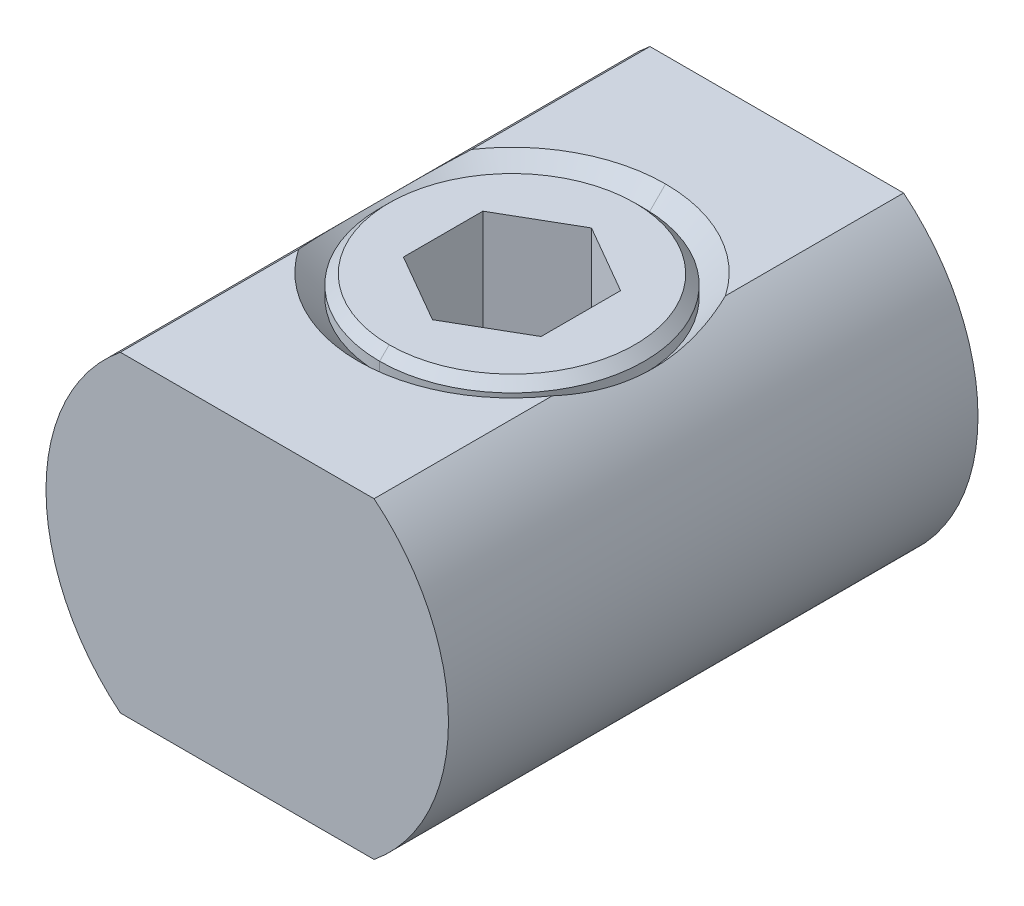
ISO-10303-21;
HEADER;
FILE_DESCRIPTION(('STEP AP214'),'2;1');
FILE_NAME('part.step','',(''),(''),'','','');
FILE_SCHEMA(('AUTOMOTIVE_DESIGN { 1 0 10303 214 1 1 1 1 }'));
ENDSEC;
DATA;
#1=APPLICATION_CONTEXT('core data for automotive mechanical design processes');
#2=APPLICATION_PROTOCOL_DEFINITION('international standard','automotive_design',2000,#1);
#3=PRODUCT_CONTEXT('',#1,'mechanical');
#4=PRODUCT('Part','Part','',(#3));
#5=PRODUCT_RELATED_PRODUCT_CATEGORY('part','',(#4));
#6=PRODUCT_DEFINITION_FORMATION('','',#4);
#7=PRODUCT_DEFINITION_CONTEXT('part definition',#1,'design');
#8=PRODUCT_DEFINITION('design','',#6,#7);
#9=PRODUCT_DEFINITION_SHAPE('','',#8);
#10=(LENGTH_UNIT() NAMED_UNIT(*) SI_UNIT(.MILLI.,.METRE.));
#11=(NAMED_UNIT(*) PLANE_ANGLE_UNIT() SI_UNIT($,.RADIAN.));
#12=(NAMED_UNIT(*) SI_UNIT($,.STERADIAN.) SOLID_ANGLE_UNIT());
#13=UNCERTAINTY_MEASURE_WITH_UNIT(LENGTH_MEASURE(1.E-05),#10,'distance_accuracy_value','');
#14=(GEOMETRIC_REPRESENTATION_CONTEXT(3) GLOBAL_UNCERTAINTY_ASSIGNED_CONTEXT((#13)) GLOBAL_UNIT_ASSIGNED_CONTEXT((#10,
#11,#12)) REPRESENTATION_CONTEXT('',''));
#15=CARTESIAN_POINT('',(0.,0.,0.));
#16=DIRECTION('',(0.,0.,1.));
#17=DIRECTION('',(1.,0.,0.));
#18=AXIS2_PLACEMENT_3D('',#15,#16,#17);
#19=CARTESIAN_POINT('',(0.,2.95,0.));
#20=DIRECTION('',(0.,-1.,0.));
#21=DIRECTION('',(1.,0.,0.));
#22=AXIS2_PLACEMENT_3D('',#19,#20,#21);
#23=CONICAL_SURFACE('',#22,1.15,0.785398163397448);
#24=DIRECTION('',(0.,-0.707106781186548,0.707106781186548));
#25=VECTOR('',#24,1.);
#26=CARTESIAN_POINT('',(0.,2.94,1.16));
#27=LINE('',#26,#25);
#28=CARTESIAN_POINT('',(0.,2.94,1.16));
#29=VERTEX_POINT('',#28);
#30=CARTESIAN_POINT('',(0.,2.85,1.25));
#31=VERTEX_POINT('',#30);
#32=EDGE_CURVE('E11',#29,#31,#27,.T.);
#33=ORIENTED_EDGE('',*,*,#32,.F.);
#34=CARTESIAN_POINT('',(0.,2.94,0.));
#35=DIRECTION('',(0.,1.,0.));
#36=DIRECTION('',(0.,0.,1.));
#37=AXIS2_PLACEMENT_3D('',#34,#35,#36);
#38=CIRCLE('',#37,1.16);
#39=CARTESIAN_POINT('',(0.,2.94,-1.16));
#40=VERTEX_POINT('',#39);
#41=EDGE_CURVE('E25',#40,#29,#38,.T.);
#42=ORIENTED_EDGE('',*,*,#41,.F.);
#43=DIRECTION('',(0.,-0.707106781186548,-0.707106781186548));
#44=VECTOR('',#43,1.);
#45=CARTESIAN_POINT('',(0.,2.94,-1.16));
#46=LINE('',#45,#44);
#47=CARTESIAN_POINT('',(0.,2.85,-1.25));
#48=VERTEX_POINT('',#47);
#49=EDGE_CURVE('E384',#40,#48,#46,.T.);
#50=ORIENTED_EDGE('',*,*,#49,.T.);
#51=CARTESIAN_POINT('',(0.,2.85,0.));
#52=DIRECTION('',(0.,-1.,0.));
#53=DIRECTION('',(0.,0.,-1.));
#54=AXIS2_PLACEMENT_3D('',#51,#52,#53);
#55=CIRCLE('',#54,1.25);
#56=EDGE_CURVE('E379',#31,#48,#55,.T.);
#57=ORIENTED_EDGE('',*,*,#56,.F.);
#58=EDGE_LOOP('',(#33,#42,#50,#57));
#59=FACE_BOUND('',#58,.T.);
#60=ADVANCED_FACE('F17',(#59),#23,.T.);
#61=CARTESIAN_POINT('',(0.,0.,0.));
#62=DIRECTION('',(0.,-1.,0.));
#63=DIRECTION('',(1.,0.,0.));
#64=AXIS2_PLACEMENT_3D('',#61,#62,#63);
#65=CYLINDRICAL_SURFACE('',#64,1.25);
#66=DIRECTION('',(0.,-1.,0.));
#67=VECTOR('',#66,1.);
#68=CARTESIAN_POINT('',(0.,2.85,1.25));
#69=LINE('',#68,#67);
#70=CARTESIAN_POINT('',(0.,2.75,1.25));
#71=VERTEX_POINT('',#70);
#72=EDGE_CURVE('E374',#31,#71,#69,.T.);
#73=ORIENTED_EDGE('',*,*,#72,.F.);
#74=ORIENTED_EDGE('',*,*,#56,.T.);
#75=DIRECTION('',(0.,-1.,0.));
#76=VECTOR('',#75,1.);
#77=CARTESIAN_POINT('',(0.,2.85,-1.25));
#78=LINE('',#77,#76);
#79=CARTESIAN_POINT('',(0.,2.75,-1.25));
#80=VERTEX_POINT('',#79);
#81=EDGE_CURVE('E370',#48,#80,#78,.T.);
#82=ORIENTED_EDGE('',*,*,#81,.T.);
#83=CARTESIAN_POINT('',(0.,2.75,0.));
#84=DIRECTION('',(0.,-1.,0.));
#85=DIRECTION('',(0.,0.,-1.));
#86=AXIS2_PLACEMENT_3D('',#83,#84,#85);
#87=CIRCLE('',#86,1.25);
#88=EDGE_CURVE('E365',#71,#80,#87,.T.);
#89=ORIENTED_EDGE('',*,*,#88,.F.);
#90=EDGE_LOOP('',(#73,#74,#82,#89));
#91=FACE_BOUND('',#90,.T.);
#92=ADVANCED_FACE('F343',(#91),#65,.T.);
#93=CARTESIAN_POINT('',(0.,2.75,0.));
#94=DIRECTION('',(0.,1.,0.));
#95=DIRECTION('',(1.,0.,0.));
#96=AXIS2_PLACEMENT_3D('',#93,#94,#95);
#97=CONICAL_SURFACE('',#96,1.25,0.785398163397447);
#98=DIRECTION('',(0.,0.707106781186549,-0.707106781186546));
#99=VECTOR('',#98,1.);
#100=CARTESIAN_POINT('',(0.,2.75,-1.25));
#101=LINE('',#100,#99);
#102=CARTESIAN_POINT('',(0.,2.95,-1.45));
#103=VERTEX_POINT('',#102);
#104=EDGE_CURVE('E361',#80,#103,#101,.T.);
#105=ORIENTED_EDGE('',*,*,#104,.T.);
#106=CARTESIAN_POINT('',(0.,2.95,0.));
#107=DIRECTION('',(0.,-1.,0.));
#108=DIRECTION('',(0.,0.,-1.));
#109=AXIS2_PLACEMENT_3D('',#106,#107,#108);
#110=CIRCLE('',#109,1.45);
#111=CARTESIAN_POINT('',(-1.1976539567003,2.95,-0.817389136213661));
#112=VERTEX_POINT('',#111);
#113=EDGE_CURVE('E358',#112,#103,#110,.T.);
#114=ORIENTED_EDGE('',*,*,#113,.F.);
#115=CARTESIAN_POINT('',(-1.1976539567003,2.95,0.817389136213661));
#116=CARTESIAN_POINT('',(-1.20499943906959,2.94403534099518,0.796044876758266));
#117=CARTESIAN_POINT('',(-1.21203600378579,2.93823115801739,0.774549421791333));
#118=CARTESIAN_POINT('',(-1.22551400414405,2.9269617962507,0.731225894182507));
#119=CARTESIAN_POINT('',(-1.23195400022894,2.9214974474256,0.709397157807462));
#120=CARTESIAN_POINT('',(-1.24423674402112,2.91094585609487,0.665442832619522));
#121=CARTESIAN_POINT('',(-1.25007853287409,2.90585922249975,0.643316829595896));
#122=CARTESIAN_POINT('',(-1.26116203711495,2.89609989356746,0.598803638407146));
#123=CARTESIAN_POINT('',(-1.2664032399539,2.89142755255154,0.576416244856476));
#124=CARTESIAN_POINT('',(-1.27628251044217,2.88253228688181,0.531416017461366));
#125=CARTESIAN_POINT('',(-1.28092047794947,2.87830943686826,0.508803146855023));
#126=CARTESIAN_POINT('',(-1.28958943539995,2.87034716682095,0.463387730011034));
#127=CARTESIAN_POINT('',(-1.29362070250864,2.86660752614853,0.440585275437996));
#128=CARTESIAN_POINT('',(-1.30107166325794,2.85964381821113,0.394826528792098));
#129=CARTESIAN_POINT('',(-1.30449197468232,2.85641923049012,0.37187041675068));
#130=CARTESIAN_POINT('',(-1.31071440081976,2.85051667981493,0.3258401094905));
#131=CARTESIAN_POINT('',(-1.31351743612449,2.84783790330247,0.302766143352973));
#132=CARTESIAN_POINT('',(-1.31849999043289,2.84305324126789,0.25653637130887));
#133=CARTESIAN_POINT('',(-1.32068068557431,2.84094627547649,0.23338080463088));
#134=CARTESIAN_POINT('',(-1.3244038493367,2.83733666497289,0.186984326875741));
#135=CARTESIAN_POINT('',(-1.32594667924238,2.83583367818258,0.163743471652671));
#136=CARTESIAN_POINT('',(-1.32839172834965,2.83344703885945,0.117138227337522));
#137=CARTESIAN_POINT('',(-1.32929234058334,2.83256493999357,0.0937736747145921));
#138=CARTESIAN_POINT('',(-1.33047031586558,2.8314104857062,0.0469650829009063));
#139=CARTESIAN_POINT('',(-1.33074636824734,2.8311394125539,0.0235209797630228));
#140=CARTESIAN_POINT('',(-1.33068153274638,2.83120303039267,-0.0234013232265701));
#141=CARTESIAN_POINT('',(-1.33033969967211,2.8315386494528,-0.0468795203277396));
#142=CARTESIAN_POINT('',(-1.32904510073533,2.83280703290893,-0.0938242723043985));
#143=CARTESIAN_POINT('',(-1.32809177652428,2.83374034305147,-0.117290796903706));
#144=CARTESIAN_POINT('',(-1.32557720137083,2.8361936553676,-0.164166503616943));
#145=CARTESIAN_POINT('',(-1.3240157942358,2.83771380827718,-0.18757566944181));
#146=CARTESIAN_POINT('',(-1.32028598643623,2.84132779872265,-0.234290904625189));
#147=CARTESIAN_POINT('',(-1.31811784795126,2.84342138845784,-0.257597014107292));
#148=CARTESIAN_POINT('',(-1.31317316192843,2.84816713306461,-0.304060302021385));
#149=CARTESIAN_POINT('',(-1.31039731195929,2.85081864738139,-0.32721762012797));
#150=CARTESIAN_POINT('',(-1.30423441693467,2.85666225415219,-0.373337605739606));
#151=CARTESIAN_POINT('',(-1.30084852168582,2.85985332896384,-0.396300555769178));
#152=CARTESIAN_POINT('',(-1.29345862830044,2.86675798910105,-0.441985444385642));
#153=CARTESIAN_POINT('',(-1.28945625585148,2.87047019794749,-0.464707853555147));
#154=CARTESIAN_POINT('',(-1.28082640492113,2.87839511576093,-0.509903692807996));
#155=CARTESIAN_POINT('',(-1.27620001046081,2.88260695529726,-0.532377483110251));
#156=CARTESIAN_POINT('',(-1.26634472854237,2.89147984407849,-0.577124289452938));
#157=CARTESIAN_POINT('',(-1.26111531377511,2.89614128588512,-0.599397111126049));
#158=CARTESIAN_POINT('',(-1.25005034013955,2.90588379439506,-0.643709278484981));
#159=CARTESIAN_POINT('',(-1.24421453204225,2.91096503345875,-0.665748524036783));
#160=CARTESIAN_POINT('',(-1.23194141152339,2.92150816556906,-0.709561621221625));
#161=CARTESIAN_POINT('',(-1.22550422259579,2.9269699804059,-0.73133552630888));
#162=CARTESIAN_POINT('',(-1.21203023042744,2.93823597986533,-0.774585306120801));
#163=CARTESIAN_POINT('',(-1.20499395747761,2.94403986032944,-0.796061425249165));
#164=CARTESIAN_POINT('',(-1.1976539567003,2.95,-0.81738913621366));
#165=B_SPLINE_CURVE_WITH_KNOTS('',3,(#115,#116,#117,#118,#119,#120,#121,#122,#123,#124,#125,
#126,#127,#128,#129,#130,#131,#132,#133,#134,#135,#136,#137,#138,#139,#140,#141,#142,#143,#144,
#145,#146,#147,#148,#149,#150,#151,#152,#153,#154,#155,#156,#157,#158,#159,#160,#161,#162,#163,
#164),.UNSPECIFIED.,.F.,.F.,(4,2,2,2,2,2,2,2,2,2,2,2,2,2,2,2,2,2,2,2,2,2,2,2,4),(0.,
0.0700397975524778,0.14024442770659,0.210559881720511,0.280934903964581,0.351321594168754,
0.421676030607221,0.491958918559779,0.562136267459855,0.632180098964353,0.702184203349884,
0.772362864319781,0.84268866228395,0.913122130062129,0.983620001903582,1.05413599383523,
1.12462156145893,1.1950266416913,1.26530038555222,1.33539188956132,1.40536316553743,
1.4753960984086,1.54545792968426,1.61550540520953,1.68549150893796),.UNSPECIFIED.);
#166=CARTESIAN_POINT('',(-1.1976539567003,2.95,0.817389136213661));
#167=VERTEX_POINT('',#166);
#168=EDGE_CURVE('E285',#167,#112,#165,.T.);
#169=ORIENTED_EDGE('',*,*,#168,.F.);
#170=CARTESIAN_POINT('',(0.,2.95,0.));
#171=DIRECTION('',(0.,-1.,0.));
#172=DIRECTION('',(0.,0.,-1.));
#173=AXIS2_PLACEMENT_3D('',#170,#171,#172);
#174=CIRCLE('',#173,1.45);
#175=CARTESIAN_POINT('',(0.,2.95,1.45));
#176=VERTEX_POINT('',#175);
#177=EDGE_CURVE('E410',#176,#167,#174,.T.);
#178=ORIENTED_EDGE('',*,*,#177,.F.);
#179=DIRECTION('',(0.,0.707106781186549,0.707106781186546));
#180=VECTOR('',#179,1.);
#181=CARTESIAN_POINT('',(0.,2.75,1.25));
#182=LINE('',#181,#180);
#183=EDGE_CURVE('E408',#71,#176,#182,.T.);
#184=ORIENTED_EDGE('',*,*,#183,.F.);
#185=ORIENTED_EDGE('',*,*,#88,.T.);
#186=EDGE_LOOP('',(#105,#114,#169,#178,#184,#185));
#187=FACE_BOUND('',#186,.T.);
#188=ADVANCED_FACE('F339',(#187),#97,.F.);
#189=CARTESIAN_POINT('',(0.,2.75,0.));
#190=DIRECTION('',(0.,1.,0.));
#191=DIRECTION('',(-1.,0.,0.));
#192=AXIS2_PLACEMENT_3D('',#189,#190,#191);
#193=CONICAL_SURFACE('',#192,1.25,0.785398163397447);
#194=ORIENTED_EDGE('',*,*,#104,.F.);
#195=CARTESIAN_POINT('',(0.,2.75,0.));
#196=DIRECTION('',(0.,-1.,0.));
#197=DIRECTION('',(0.,0.,-1.));
#198=AXIS2_PLACEMENT_3D('',#195,#196,#197);
#199=CIRCLE('',#198,1.25);
#200=EDGE_CURVE('E412',#80,#71,#199,.T.);
#201=ORIENTED_EDGE('',*,*,#200,.T.);
#202=ORIENTED_EDGE('',*,*,#183,.T.);
#203=CARTESIAN_POINT('',(0.,2.95,0.));
#204=DIRECTION('',(0.,-1.,0.));
#205=DIRECTION('',(0.,0.,-1.));
#206=AXIS2_PLACEMENT_3D('',#203,#204,#205);
#207=CIRCLE('',#206,1.45);
#208=CARTESIAN_POINT('',(1.1976539567003,2.95,0.817389136213666));
#209=VERTEX_POINT('',#208);
#210=EDGE_CURVE('E414',#209,#176,#207,.T.);
#211=ORIENTED_EDGE('',*,*,#210,.F.);
#212=CARTESIAN_POINT('',(1.1976539567003,2.95,-0.817389136213663));
#213=CARTESIAN_POINT('',(1.20499943906959,2.94403534099518,-0.796044876758269));
#214=CARTESIAN_POINT('',(1.21203600378579,2.93823115801739,-0.774549421791335));
#215=CARTESIAN_POINT('',(1.22551400414405,2.92696179625069,-0.731225894182509));
#216=CARTESIAN_POINT('',(1.23195400022893,2.9214974474256,-0.709397157807463));
#217=CARTESIAN_POINT('',(1.24423674402112,2.91094585609487,-0.665442832619523));
#218=CARTESIAN_POINT('',(1.25007853287408,2.90585922249974,-0.643316829595897));
#219=CARTESIAN_POINT('',(1.26116203711495,2.89609989356745,-0.598803638407147));
#220=CARTESIAN_POINT('',(1.2664032399539,2.89142755255154,-0.576416244856477));
#221=CARTESIAN_POINT('',(1.27628251044216,2.8825322868818,-0.531416017461367));
#222=CARTESIAN_POINT('',(1.28092047794947,2.87830943686826,-0.508803146855024));
#223=CARTESIAN_POINT('',(1.28958943539994,2.87034716682095,-0.463387730011035));
#224=CARTESIAN_POINT('',(1.29362070250863,2.86660752614853,-0.440585275437997));
#225=CARTESIAN_POINT('',(1.30107166325794,2.85964381821113,-0.394826528792098));
#226=CARTESIAN_POINT('',(1.30449197468232,2.85641923049012,-0.37187041675068));
#227=CARTESIAN_POINT('',(1.31071440081976,2.85051667981492,-0.325840109490501));
#228=CARTESIAN_POINT('',(1.31351743612448,2.84783790330247,-0.302766143352974));
#229=CARTESIAN_POINT('',(1.31849999043289,2.84305324126788,-0.25653637130887));
#230=CARTESIAN_POINT('',(1.3206806855743,2.84094627547649,-0.23338080463088));
#231=CARTESIAN_POINT('',(1.32440384933669,2.83733666497288,-0.186984326875741));
#232=CARTESIAN_POINT('',(1.32594667924237,2.83583367818258,-0.163743471652671));
#233=CARTESIAN_POINT('',(1.32839172834965,2.83344703885945,-0.117138227337522));
#234=CARTESIAN_POINT('',(1.32929234058333,2.83256493999357,-0.0937736747145917));
#235=CARTESIAN_POINT('',(1.33047031586557,2.8314104857062,-0.0469650829009056));
#236=CARTESIAN_POINT('',(1.33074636824733,2.8311394125539,-0.0235209797630217));
#237=CARTESIAN_POINT('',(1.33068153274637,2.83120303039266,0.0234013232265716));
#238=CARTESIAN_POINT('',(1.33033969967211,2.83153864945279,0.0468795203277412));
#239=CARTESIAN_POINT('',(1.32904510073533,2.83280703290893,0.0938242723043996));
#240=CARTESIAN_POINT('',(1.32809177652428,2.83374034305146,0.117290796903706));
#241=CARTESIAN_POINT('',(1.32557720137082,2.8361936553676,0.164166503616944));
#242=CARTESIAN_POINT('',(1.3240157942358,2.83771380827718,0.187575669441811));
#243=CARTESIAN_POINT('',(1.32028598643622,2.84132779872265,0.234290904625191));
#244=CARTESIAN_POINT('',(1.31811784795126,2.84342138845783,0.257597014107294));
#245=CARTESIAN_POINT('',(1.31317316192843,2.84816713306461,0.304060302021387));
#246=CARTESIAN_POINT('',(1.31039731195929,2.85081864738139,0.327217620127971));
#247=CARTESIAN_POINT('',(1.30423441693467,2.85666225415219,0.373337605739608));
#248=CARTESIAN_POINT('',(1.30084852168582,2.85985332896384,0.396300555769181));
#249=CARTESIAN_POINT('',(1.29345862830043,2.86675798910105,0.441985444385646));
#250=CARTESIAN_POINT('',(1.28945625585147,2.87047019794749,0.46470785355515));
#251=CARTESIAN_POINT('',(1.28082640492113,2.87839511576093,0.509903692807999));
#252=CARTESIAN_POINT('',(1.2762000104608,2.88260695529726,0.532377483110255));
#253=CARTESIAN_POINT('',(1.26634472854236,2.89147984407849,0.577124289452941));
#254=CARTESIAN_POINT('',(1.2611153137751,2.89614128588512,0.599397111126053));
#255=CARTESIAN_POINT('',(1.25005034013955,2.90588379439506,0.643709278484985));
#256=CARTESIAN_POINT('',(1.24421453204224,2.91096503345875,0.665748524036787));
#257=CARTESIAN_POINT('',(1.23194141152339,2.92150816556906,0.70956162122163));
#258=CARTESIAN_POINT('',(1.22550422259579,2.9269699804059,0.731335526308885));
#259=CARTESIAN_POINT('',(1.21203023042744,2.93823597986533,0.774585306120806));
#260=CARTESIAN_POINT('',(1.2049939574776,2.94403986032944,0.796061425249171));
#261=CARTESIAN_POINT('',(1.1976539567003,2.95,0.817389136213666));
#262=B_SPLINE_CURVE_WITH_KNOTS('',3,(#212,#213,#214,#215,#216,#217,#218,#219,#220,#221,#222,
#223,#224,#225,#226,#227,#228,#229,#230,#231,#232,#233,#234,#235,#236,#237,#238,#239,#240,#241,
#242,#243,#244,#245,#246,#247,#248,#249,#250,#251,#252,#253,#254,#255,#256,#257,#258,#259,#260,
#261),.UNSPECIFIED.,.F.,.F.,(4,2,2,2,2,2,2,2,2,2,2,2,2,2,2,2,2,2,2,2,2,2,2,2,4),(0.,
0.0700397975524772,0.140244427706591,0.210559881720513,0.280934903964582,0.351321594168755,
0.421676030607222,0.491958918559781,0.562136267459856,0.632180098964355,0.702184203349887,
0.772362864319783,0.842688662283954,0.913122130062133,0.983620001903584,1.05413599383523,
1.12462156145894,1.19502664169131,1.26530038555222,1.33539188956132,1.40536316553744,
1.4753960984086,1.54545792968427,1.61550540520954,1.68549150893797),.UNSPECIFIED.);
#263=CARTESIAN_POINT('',(1.1976539567003,2.95,-0.817389136213663));
#264=VERTEX_POINT('',#263);
#265=EDGE_CURVE('E321',#264,#209,#262,.T.);
#266=ORIENTED_EDGE('',*,*,#265,.F.);
#267=CARTESIAN_POINT('',(0.,2.95,0.));
#268=DIRECTION('',(0.,-1.,0.));
#269=DIRECTION('',(0.,0.,-1.));
#270=AXIS2_PLACEMENT_3D('',#267,#268,#269);
#271=CIRCLE('',#270,1.45);
#272=EDGE_CURVE('E316',#103,#264,#271,.T.);
#273=ORIENTED_EDGE('',*,*,#272,.F.);
#274=EDGE_LOOP('',(#194,#201,#202,#211,#266,#273));
#275=FACE_BOUND('',#274,.T.);
#276=ADVANCED_FACE('F329',(#275),#193,.F.);
#277=CARTESIAN_POINT('',(1.1976539567003,2.95,2.5));
#278=DIRECTION('',(0.,-1.,0.));
#279=DIRECTION('',(0.,0.,-1.));
#280=AXIS2_PLACEMENT_3D('',#277,#278,#279);
#281=PLANE('',#280);
#282=DIRECTION('',(0.,0.,-1.));
#283=VECTOR('',#282,1.);
#284=CARTESIAN_POINT('',(-1.1976539567003,2.95,2.5));
#285=LINE('',#284,#283);
#286=CARTESIAN_POINT('',(-1.1976539567003,2.95,-2.5));
#287=VERTEX_POINT('',#286);
#288=EDGE_CURVE('E312',#112,#287,#285,.T.);
#289=ORIENTED_EDGE('',*,*,#288,.F.);
#290=ORIENTED_EDGE('',*,*,#113,.T.);
#291=ORIENTED_EDGE('',*,*,#272,.T.);
#292=DIRECTION('',(0.,0.,-1.));
#293=VECTOR('',#292,1.);
#294=CARTESIAN_POINT('',(1.1976539567003,2.95,2.5));
#295=LINE('',#294,#293);
#296=CARTESIAN_POINT('',(1.1976539567003,2.95,-2.5));
#297=VERTEX_POINT('',#296);
#298=EDGE_CURVE('E308',#264,#297,#295,.T.);
#299=ORIENTED_EDGE('',*,*,#298,.T.);
#300=DIRECTION('',(-1.,0.,0.));
#301=VECTOR('',#300,1.);
#302=CARTESIAN_POINT('',(1.1976539567003,2.95,-2.5));
#303=LINE('',#302,#301);
#304=EDGE_CURVE('E304',#297,#287,#303,.T.);
#305=ORIENTED_EDGE('',*,*,#304,.T.);
#306=EDGE_LOOP('',(#289,#290,#291,#299,#305));
#307=FACE_BOUND('',#306,.T.);
#308=ADVANCED_FACE('F338',(#307),#281,.F.);
#309=CARTESIAN_POINT('',(0.,1.475,-2.5));
#310=DIRECTION('',(0.,0.,1.));
#311=DIRECTION('',(1.,0.,0.));
#312=AXIS2_PLACEMENT_3D('',#309,#310,#311);
#313=PLANE('',#312);
#314=ORIENTED_EDGE('',*,*,#304,.F.);
#315=CARTESIAN_POINT('',(0.,1.475,-2.5));
#316=DIRECTION('',(0.,0.,1.));
#317=DIRECTION('',(1.,0.,0.));
#318=AXIS2_PLACEMENT_3D('',#315,#316,#317);
#319=CIRCLE('',#318,1.89999999999992);
#320=CARTESIAN_POINT('',(1.1976539567003,0.,-2.5));
#321=VERTEX_POINT('',#320);
#322=EDGE_CURVE('E299',#321,#297,#319,.T.);
#323=ORIENTED_EDGE('',*,*,#322,.F.);
#324=DIRECTION('',(1.,0.,0.));
#325=VECTOR('',#324,1.);
#326=CARTESIAN_POINT('',(-1.1976539567003,0.,-2.5));
#327=LINE('',#326,#325);
#328=CARTESIAN_POINT('',(-1.1976539567003,0.,-2.5));
#329=VERTEX_POINT('',#328);
#330=EDGE_CURVE('E294',#329,#321,#327,.T.);
#331=ORIENTED_EDGE('',*,*,#330,.F.);
#332=CARTESIAN_POINT('',(0.,1.475,-2.5));
#333=DIRECTION('',(0.,0.,1.));
#334=DIRECTION('',(1.,0.,0.));
#335=AXIS2_PLACEMENT_3D('',#332,#333,#334);
#336=CIRCLE('',#335,1.89999999999992);
#337=EDGE_CURVE('E288',#287,#329,#336,.T.);
#338=ORIENTED_EDGE('',*,*,#337,.F.);
#339=EDGE_LOOP('',(#314,#323,#331,#338));
#340=FACE_BOUND('',#339,.T.);
#341=ADVANCED_FACE('F266',(#340),#313,.F.);
#342=CARTESIAN_POINT('',(0.,1.475,2.5));
#343=DIRECTION('',(0.,0.,-1.));
#344=DIRECTION('',(1.,0.,0.));
#345=AXIS2_PLACEMENT_3D('',#342,#343,#344);
#346=CYLINDRICAL_SURFACE('',#345,1.89999999999992);
#347=DIRECTION('',(0.,0.,-1.));
#348=VECTOR('',#347,1.);
#349=CARTESIAN_POINT('',(-1.1976539567003,2.95,2.5));
#350=LINE('',#349,#348);
#351=CARTESIAN_POINT('',(-1.1976539567003,2.95,2.5));
#352=VERTEX_POINT('',#351);
#353=EDGE_CURVE('E286',#352,#167,#350,.T.);
#354=ORIENTED_EDGE('',*,*,#353,.T.);
#355=ORIENTED_EDGE('',*,*,#168,.T.);
#356=ORIENTED_EDGE('',*,*,#288,.T.);
#357=ORIENTED_EDGE('',*,*,#337,.T.);
#358=DIRECTION('',(0.,0.,-1.));
#359=VECTOR('',#358,1.);
#360=CARTESIAN_POINT('',(-1.1976539567003,0.,2.5));
#361=LINE('',#360,#359);
#362=CARTESIAN_POINT('',(-1.1976539567003,0.,2.5));
#363=VERTEX_POINT('',#362);
#364=EDGE_CURVE('E289',#363,#329,#361,.T.);
#365=ORIENTED_EDGE('',*,*,#364,.F.);
#366=CARTESIAN_POINT('',(0.,1.475,2.5));
#367=DIRECTION('',(0.,0.,1.));
#368=DIRECTION('',(1.,0.,0.));
#369=AXIS2_PLACEMENT_3D('',#366,#367,#368);
#370=CIRCLE('',#369,1.89999999999992);
#371=EDGE_CURVE('E433',#352,#363,#370,.T.);
#372=ORIENTED_EDGE('',*,*,#371,.F.);
#373=EDGE_LOOP('',(#354,#355,#356,#357,#365,#372));
#374=FACE_BOUND('',#373,.T.);
#375=ADVANCED_FACE('F261',(#374),#346,.T.);
#376=CARTESIAN_POINT('',(0.,1.475,2.5));
#377=DIRECTION('',(0.,0.,1.));
#378=DIRECTION('',(1.,0.,0.));
#379=AXIS2_PLACEMENT_3D('',#376,#377,#378);
#380=PLANE('',#379);
#381=DIRECTION('',(-1.,0.,0.));
#382=VECTOR('',#381,1.);
#383=CARTESIAN_POINT('',(1.1976539567003,2.95,2.5));
#384=LINE('',#383,#382);
#385=CARTESIAN_POINT('',(1.1976539567003,2.95,2.5));
#386=VERTEX_POINT('',#385);
#387=EDGE_CURVE('E431',#386,#352,#384,.T.);
#388=ORIENTED_EDGE('',*,*,#387,.T.);
#389=ORIENTED_EDGE('',*,*,#371,.T.);
#390=DIRECTION('',(1.,0.,0.));
#391=VECTOR('',#390,1.);
#392=CARTESIAN_POINT('',(-1.1976539567003,0.,2.5));
#393=LINE('',#392,#391);
#394=CARTESIAN_POINT('',(1.1976539567003,0.,2.5));
#395=VERTEX_POINT('',#394);
#396=EDGE_CURVE('E434',#363,#395,#393,.T.);
#397=ORIENTED_EDGE('',*,*,#396,.T.);
#398=CARTESIAN_POINT('',(0.,1.475,2.5));
#399=DIRECTION('',(0.,0.,1.));
#400=DIRECTION('',(1.,0.,0.));
#401=AXIS2_PLACEMENT_3D('',#398,#399,#400);
#402=CIRCLE('',#401,1.89999999999992);
#403=EDGE_CURVE('E236',#395,#386,#402,.T.);
#404=ORIENTED_EDGE('',*,*,#403,.T.);
#405=EDGE_LOOP('',(#388,#389,#397,#404));
#406=FACE_BOUND('',#405,.T.);
#407=ADVANCED_FACE('F256',(#406),#380,.T.);
#408=CARTESIAN_POINT('',(0.,1.475,2.5));
#409=DIRECTION('',(0.,0.,-1.));
#410=DIRECTION('',(-1.,0.,0.));
#411=AXIS2_PLACEMENT_3D('',#408,#409,#410);
#412=CYLINDRICAL_SURFACE('',#411,1.89999999999992);
#413=ORIENTED_EDGE('',*,*,#298,.F.);
#414=ORIENTED_EDGE('',*,*,#265,.T.);
#415=DIRECTION('',(0.,0.,-1.));
#416=VECTOR('',#415,1.);
#417=CARTESIAN_POINT('',(1.1976539567003,2.95,2.5));
#418=LINE('',#417,#416);
#419=EDGE_CURVE('E231',#386,#209,#418,.T.);
#420=ORIENTED_EDGE('',*,*,#419,.F.);
#421=ORIENTED_EDGE('',*,*,#403,.F.);
#422=DIRECTION('',(0.,0.,-1.));
#423=VECTOR('',#422,1.);
#424=CARTESIAN_POINT('',(1.1976539567003,0.,2.5));
#425=LINE('',#424,#423);
#426=EDGE_CURVE('E226',#395,#321,#425,.T.);
#427=ORIENTED_EDGE('',*,*,#426,.T.);
#428=ORIENTED_EDGE('',*,*,#322,.T.);
#429=EDGE_LOOP('',(#413,#414,#420,#421,#427,#428));
#430=FACE_BOUND('',#429,.T.);
#431=ADVANCED_FACE('F245',(#430),#412,.T.);
#432=CARTESIAN_POINT('',(-1.1976539567003,0.,2.5));
#433=DIRECTION('',(0.,1.,0.));
#434=DIRECTION('',(0.,0.,1.));
#435=AXIS2_PLACEMENT_3D('',#432,#433,#434);
#436=PLANE('',#435);
#437=ORIENTED_EDGE('',*,*,#330,.T.);
#438=ORIENTED_EDGE('',*,*,#426,.F.);
#439=ORIENTED_EDGE('',*,*,#396,.F.);
#440=ORIENTED_EDGE('',*,*,#364,.T.);
#441=EDGE_LOOP('',(#437,#438,#439,#440));
#442=FACE_BOUND('',#441,.T.);
#443=ADVANCED_FACE('F255',(#442),#436,.F.);
#444=CARTESIAN_POINT('',(1.1976539567003,2.95,2.5));
#445=DIRECTION('',(0.,-1.,0.));
#446=DIRECTION('',(0.,0.,-1.));
#447=AXIS2_PLACEMENT_3D('',#444,#445,#446);
#448=PLANE('',#447);
#449=ORIENTED_EDGE('',*,*,#419,.T.);
#450=ORIENTED_EDGE('',*,*,#210,.T.);
#451=ORIENTED_EDGE('',*,*,#177,.T.);
#452=ORIENTED_EDGE('',*,*,#353,.F.);
#453=ORIENTED_EDGE('',*,*,#387,.F.);
#454=EDGE_LOOP('',(#449,#450,#451,#452,#453));
#455=FACE_BOUND('',#454,.T.);
#456=ADVANCED_FACE('F428',(#455),#448,.F.);
#457=CARTESIAN_POINT('',(0.,0.,0.));
#458=DIRECTION('',(0.,-1.,0.));
#459=DIRECTION('',(-1.,0.,0.));
#460=AXIS2_PLACEMENT_3D('',#457,#458,#459);
#461=CYLINDRICAL_SURFACE('',#460,1.25);
#462=ORIENTED_EDGE('',*,*,#72,.T.);
#463=ORIENTED_EDGE('',*,*,#200,.F.);
#464=ORIENTED_EDGE('',*,*,#81,.F.);
#465=CARTESIAN_POINT('',(0.,2.85,0.));
#466=DIRECTION('',(0.,-1.,0.));
#467=DIRECTION('',(0.,0.,-1.));
#468=AXIS2_PLACEMENT_3D('',#465,#466,#467);
#469=CIRCLE('',#468,1.25);
#470=EDGE_CURVE('E221',#48,#31,#469,.T.);
#471=ORIENTED_EDGE('',*,*,#470,.T.);
#472=EDGE_LOOP('',(#462,#463,#464,#471));
#473=FACE_BOUND('',#472,.T.);
#474=ADVANCED_FACE('F402',(#473),#461,.T.);
#475=CARTESIAN_POINT('',(0.,2.95,0.));
#476=DIRECTION('',(0.,-1.,0.));
#477=DIRECTION('',(-1.,0.,0.));
#478=AXIS2_PLACEMENT_3D('',#475,#476,#477);
#479=CONICAL_SURFACE('',#478,1.15,0.785398163397448);
#480=ORIENTED_EDGE('',*,*,#32,.T.);
#481=ORIENTED_EDGE('',*,*,#470,.F.);
#482=ORIENTED_EDGE('',*,*,#49,.F.);
#483=CARTESIAN_POINT('',(0.,2.94,0.));
#484=DIRECTION('',(0.,1.,0.));
#485=DIRECTION('',(0.,0.,1.));
#486=AXIS2_PLACEMENT_3D('',#483,#484,#485);
#487=CIRCLE('',#486,1.16);
#488=EDGE_CURVE('E217',#29,#40,#487,.T.);
#489=ORIENTED_EDGE('',*,*,#488,.F.);
#490=EDGE_LOOP('',(#480,#481,#482,#489));
#491=FACE_BOUND('',#490,.T.);
#492=ADVANCED_FACE('F397',(#491),#479,.T.);
#493=CARTESIAN_POINT('',(0.,2.94,0.));
#494=DIRECTION('',(0.,1.,0.));
#495=DIRECTION('',(0.,0.,1.));
#496=AXIS2_PLACEMENT_3D('',#493,#494,#495);
#497=PLANE('',#496);
#498=DIRECTION('',(0.,0.,-1.));
#499=VECTOR('',#498,1.);
#500=CARTESIAN_POINT('',(-0.65,2.94,-0.37527767497326));
#501=LINE('',#500,#499);
#502=CARTESIAN_POINT('',(-0.65,2.94,0.37527767497326));
#503=VERTEX_POINT('',#502);
#504=CARTESIAN_POINT('',(-0.65,2.94,-0.37527767497326));
#505=VERTEX_POINT('',#504);
#506=EDGE_CURVE('E213',#503,#505,#501,.T.);
#507=ORIENTED_EDGE('',*,*,#506,.T.);
#508=DIRECTION('',(0.866025403784443,0.,-0.499999999999993));
#509=VECTOR('',#508,1.);
#510=CARTESIAN_POINT('',(0.,2.94,-0.75055534994651));
#511=LINE('',#510,#509);
#512=CARTESIAN_POINT('',(0.,2.94,-0.75055534994651));
#513=VERTEX_POINT('',#512);
#514=EDGE_CURVE('E209',#505,#513,#511,.T.);
#515=ORIENTED_EDGE('',*,*,#514,.T.);
#516=DIRECTION('',(0.866025403784443,0.,0.499999999999993));
#517=VECTOR('',#516,1.);
#518=CARTESIAN_POINT('',(0.65,2.94,-0.37527767497326));
#519=LINE('',#518,#517);
#520=CARTESIAN_POINT('',(0.65,2.94,-0.37527767497326));
#521=VERTEX_POINT('',#520);
#522=EDGE_CURVE('E205',#513,#521,#519,.T.);
#523=ORIENTED_EDGE('',*,*,#522,.T.);
#524=DIRECTION('',(0.,0.,1.));
#525=VECTOR('',#524,1.);
#526=CARTESIAN_POINT('',(0.65,2.94,0.37527767497326));
#527=LINE('',#526,#525);
#528=CARTESIAN_POINT('',(0.65,2.94,0.37527767497326));
#529=VERTEX_POINT('',#528);
#530=EDGE_CURVE('E201',#521,#529,#527,.T.);
#531=ORIENTED_EDGE('',*,*,#530,.T.);
#532=DIRECTION('',(-0.866025403784443,0.,0.499999999999993));
#533=VECTOR('',#532,1.);
#534=CARTESIAN_POINT('',(0.,2.94,0.75055534994651));
#535=LINE('',#534,#533);
#536=CARTESIAN_POINT('',(0.,2.94,0.75055534994651));
#537=VERTEX_POINT('',#536);
#538=EDGE_CURVE('E149',#529,#537,#535,.T.);
#539=ORIENTED_EDGE('',*,*,#538,.T.);
#540=DIRECTION('',(-0.866025403784443,0.,-0.499999999999993));
#541=VECTOR('',#540,1.);
#542=CARTESIAN_POINT('',(-0.65,2.94,0.37527767497326));
#543=LINE('',#542,#541);
#544=EDGE_CURVE('E194',#537,#503,#543,.T.);
#545=ORIENTED_EDGE('',*,*,#544,.T.);
#546=EDGE_LOOP('',(#507,#515,#523,#531,#539,#545));
#547=FACE_BOUND('',#546,.T.);
#548=ORIENTED_EDGE('',*,*,#488,.T.);
#549=ORIENTED_EDGE('',*,*,#41,.T.);
#550=EDGE_LOOP('',(#548,#549));
#551=FACE_BOUND('',#550,.T.);
#552=ADVANCED_FACE('F393',(#547,#551),#497,.T.);
#553=CARTESIAN_POINT('',(-0.65,1.65,0.37527767497326));
#554=DIRECTION('',(-0.499999999999993,0.,0.866025403784443));
#555=DIRECTION('',(0.866025403784443,0.,0.499999999999993));
#556=AXIS2_PLACEMENT_3D('',#553,#554,#555);
#557=PLANE('',#556);
#558=ORIENTED_EDGE('',*,*,#544,.F.);
#559=DIRECTION('',(0.,1.,0.));
#560=VECTOR('',#559,1.);
#561=CARTESIAN_POINT('',(0.,1.65,0.75055534994651));
#562=LINE('',#561,#560);
#563=CARTESIAN_POINT('',(0.,1.65,0.75055534994651));
#564=VERTEX_POINT('',#563);
#565=EDGE_CURVE('E190',#564,#537,#562,.T.);
#566=ORIENTED_EDGE('',*,*,#565,.F.);
#567=DIRECTION('',(0.866025403784443,0.,0.499999999999993));
#568=VECTOR('',#567,1.);
#569=CARTESIAN_POINT('',(-0.65,1.65,0.37527767497326));
#570=LINE('',#569,#568);
#571=CARTESIAN_POINT('',(-0.65,1.65,0.37527767497326));
#572=VERTEX_POINT('',#571);
#573=EDGE_CURVE('E144',#572,#564,#570,.T.);
#574=ORIENTED_EDGE('',*,*,#573,.F.);
#575=DIRECTION('',(0.,1.,0.));
#576=VECTOR('',#575,1.);
#577=CARTESIAN_POINT('',(-0.65,1.65,0.37527767497326));
#578=LINE('',#577,#576);
#579=EDGE_CURVE('E182',#572,#503,#578,.T.);
#580=ORIENTED_EDGE('',*,*,#579,.T.);
#581=EDGE_LOOP('',(#558,#566,#574,#580));
#582=FACE_BOUND('',#581,.T.);
#583=ADVANCED_FACE('F556',(#582),#557,.F.);
#584=CARTESIAN_POINT('',(-0.65,1.65,-0.37527767497326));
#585=DIRECTION('',(-1.,0.,0.));
#586=DIRECTION('',(0.,0.,1.));
#587=AXIS2_PLACEMENT_3D('',#584,#585,#586);
#588=PLANE('',#587);
#589=ORIENTED_EDGE('',*,*,#506,.F.);
#590=ORIENTED_EDGE('',*,*,#579,.F.);
#591=DIRECTION('',(0.,0.,1.));
#592=VECTOR('',#591,1.);
#593=CARTESIAN_POINT('',(-0.65,1.65,-0.37527767497326));
#594=LINE('',#593,#592);
#595=CARTESIAN_POINT('',(-0.65,1.65,-0.37527767497326));
#596=VERTEX_POINT('',#595);
#597=EDGE_CURVE('E178',#596,#572,#594,.T.);
#598=ORIENTED_EDGE('',*,*,#597,.F.);
#599=DIRECTION('',(0.,1.,0.));
#600=VECTOR('',#599,1.);
#601=CARTESIAN_POINT('',(-0.65,1.65,-0.37527767497326));
#602=LINE('',#601,#600);
#603=EDGE_CURVE('E173',#596,#505,#602,.T.);
#604=ORIENTED_EDGE('',*,*,#603,.T.);
#605=EDGE_LOOP('',(#589,#590,#598,#604));
#606=FACE_BOUND('',#605,.T.);
#607=ADVANCED_FACE('F567',(#606),#588,.F.);
#608=CARTESIAN_POINT('',(0.,1.65,-0.75055534994651));
#609=DIRECTION('',(-0.499999999999993,0.,-0.866025403784443));
#610=DIRECTION('',(-0.866025403784443,0.,0.499999999999993));
#611=AXIS2_PLACEMENT_3D('',#608,#609,#610);
#612=PLANE('',#611);
#613=ORIENTED_EDGE('',*,*,#514,.F.);
#614=ORIENTED_EDGE('',*,*,#603,.F.);
#615=DIRECTION('',(-0.866025403784443,0.,0.499999999999993));
#616=VECTOR('',#615,1.);
#617=CARTESIAN_POINT('',(0.,1.65,-0.75055534994651));
#618=LINE('',#617,#616);
#619=CARTESIAN_POINT('',(0.,1.65,-0.75055534994651));
#620=VERTEX_POINT('',#619);
#621=EDGE_CURVE('E168',#620,#596,#618,.T.);
#622=ORIENTED_EDGE('',*,*,#621,.F.);
#623=DIRECTION('',(0.,1.,0.));
#624=VECTOR('',#623,1.);
#625=CARTESIAN_POINT('',(0.,1.65,-0.75055534994651));
#626=LINE('',#625,#624);
#627=EDGE_CURVE('E163',#620,#513,#626,.T.);
#628=ORIENTED_EDGE('',*,*,#627,.T.);
#629=EDGE_LOOP('',(#613,#614,#622,#628));
#630=FACE_BOUND('',#629,.T.);
#631=ADVANCED_FACE('F578',(#630),#612,.F.);
#632=CARTESIAN_POINT('',(0.65,1.65,-0.37527767497326));
#633=DIRECTION('',(0.499999999999993,0.,-0.866025403784443));
#634=DIRECTION('',(-0.866025403784443,0.,-0.499999999999993));
#635=AXIS2_PLACEMENT_3D('',#632,#633,#634);
#636=PLANE('',#635);
#637=ORIENTED_EDGE('',*,*,#522,.F.);
#638=ORIENTED_EDGE('',*,*,#627,.F.);
#639=DIRECTION('',(-0.866025403784443,0.,-0.499999999999993));
#640=VECTOR('',#639,1.);
#641=CARTESIAN_POINT('',(0.65,1.65,-0.37527767497326));
#642=LINE('',#641,#640);
#643=CARTESIAN_POINT('',(0.65,1.65,-0.37527767497326));
#644=VERTEX_POINT('',#643);
#645=EDGE_CURVE('E159',#644,#620,#642,.T.);
#646=ORIENTED_EDGE('',*,*,#645,.F.);
#647=DIRECTION('',(0.,1.,0.));
#648=VECTOR('',#647,1.);
#649=CARTESIAN_POINT('',(0.65,1.65,-0.37527767497326));
#650=LINE('',#649,#648);
#651=EDGE_CURVE('E135',#644,#521,#650,.T.);
#652=ORIENTED_EDGE('',*,*,#651,.T.);
#653=EDGE_LOOP('',(#637,#638,#646,#652));
#654=FACE_BOUND('',#653,.T.);
#655=ADVANCED_FACE('F589',(#654),#636,.F.);
#656=CARTESIAN_POINT('',(0.65,1.65,0.37527767497326));
#657=DIRECTION('',(1.,0.,0.));
#658=DIRECTION('',(0.,0.,-1.));
#659=AXIS2_PLACEMENT_3D('',#656,#657,#658);
#660=PLANE('',#659);
#661=ORIENTED_EDGE('',*,*,#530,.F.);
#662=ORIENTED_EDGE('',*,*,#651,.F.);
#663=DIRECTION('',(0.,0.,-1.));
#664=VECTOR('',#663,1.);
#665=CARTESIAN_POINT('',(0.65,1.65,0.37527767497326));
#666=LINE('',#665,#664);
#667=CARTESIAN_POINT('',(0.65,1.65,0.37527767497326));
#668=VERTEX_POINT('',#667);
#669=EDGE_CURVE('E127',#668,#644,#666,.T.);
#670=ORIENTED_EDGE('',*,*,#669,.F.);
#671=DIRECTION('',(0.,1.,0.));
#672=VECTOR('',#671,1.);
#673=CARTESIAN_POINT('',(0.65,1.65,0.37527767497326));
#674=LINE('',#673,#672);
#675=EDGE_CURVE('E132',#668,#529,#674,.T.);
#676=ORIENTED_EDGE('',*,*,#675,.T.);
#677=EDGE_LOOP('',(#661,#662,#670,#676));
#678=FACE_BOUND('',#677,.T.);
#679=ADVANCED_FACE('F130',(#678),#660,.F.);
#680=CARTESIAN_POINT('',(0.,1.65,0.75055534994651));
#681=DIRECTION('',(0.499999999999993,0.,0.866025403784443));
#682=DIRECTION('',(0.866025403784443,0.,-0.499999999999993));
#683=AXIS2_PLACEMENT_3D('',#680,#681,#682);
#684=PLANE('',#683);
#685=ORIENTED_EDGE('',*,*,#538,.F.);
#686=ORIENTED_EDGE('',*,*,#675,.F.);
#687=DIRECTION('',(0.866025403784443,0.,-0.499999999999993));
#688=VECTOR('',#687,1.);
#689=CARTESIAN_POINT('',(0.,1.65,0.75055534994651));
#690=LINE('',#689,#688);
#691=EDGE_CURVE('E141',#564,#668,#690,.T.);
#692=ORIENTED_EDGE('',*,*,#691,.F.);
#693=ORIENTED_EDGE('',*,*,#565,.T.);
#694=EDGE_LOOP('',(#685,#686,#692,#693));
#695=FACE_BOUND('',#694,.T.);
#696=ADVANCED_FACE('F148',(#695),#684,.F.);
#697=CARTESIAN_POINT('',(0.,1.65,0.));
#698=DIRECTION('',(0.,1.,0.));
#699=DIRECTION('',(0.,0.,1.));
#700=AXIS2_PLACEMENT_3D('',#697,#698,#699);
#701=PLANE('',#700);
#702=ORIENTED_EDGE('',*,*,#597,.T.);
#703=ORIENTED_EDGE('',*,*,#573,.T.);
#704=ORIENTED_EDGE('',*,*,#691,.T.);
#705=ORIENTED_EDGE('',*,*,#669,.T.);
#706=ORIENTED_EDGE('',*,*,#645,.T.);
#707=ORIENTED_EDGE('',*,*,#621,.T.);
#708=EDGE_LOOP('',(#702,#703,#704,#705,#706,#707));
#709=FACE_BOUND('',#708,.T.);
#710=ADVANCED_FACE('F143',(#709),#701,.T.);
#711=CLOSED_SHELL('',(#60,#92,#188,#276,#308,#341,#375,#407,#431,#443,#456,#474,#492,#552,#583,
#607,#631,#655,#679,#696,#710));
#712=MANIFOLD_SOLID_BREP('B1',#711);
#713=ADVANCED_BREP_SHAPE_REPRESENTATION('',(#18,#712),#14);
#714=SHAPE_DEFINITION_REPRESENTATION(#9,#713);
ENDSEC;
END-ISO-10303-21;
